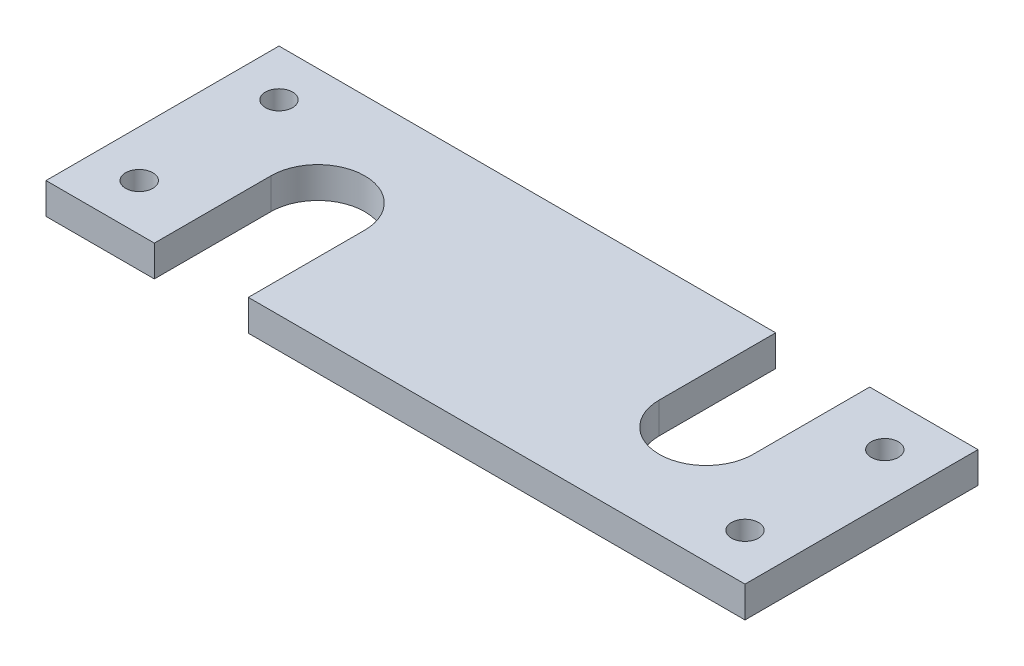
ISO-10303-21;
HEADER;
FILE_DESCRIPTION(('STEP AP214'),'2;1');
FILE_NAME('part.step','',(''),(''),'','','');
FILE_SCHEMA(('AUTOMOTIVE_DESIGN { 1 0 10303 214 1 1 1 1 }'));
ENDSEC;
DATA;
#1=APPLICATION_CONTEXT('core data for automotive mechanical design processes');
#2=APPLICATION_PROTOCOL_DEFINITION('international standard','automotive_design',2000,#1);
#3=PRODUCT_CONTEXT('',#1,'mechanical');
#4=PRODUCT('Part','Part','',(#3));
#5=PRODUCT_RELATED_PRODUCT_CATEGORY('part','',(#4));
#6=PRODUCT_DEFINITION_FORMATION('','',#4);
#7=PRODUCT_DEFINITION_CONTEXT('part definition',#1,'design');
#8=PRODUCT_DEFINITION('design','',#6,#7);
#9=PRODUCT_DEFINITION_SHAPE('','',#8);
#10=(LENGTH_UNIT() NAMED_UNIT(*) SI_UNIT(.MILLI.,.METRE.));
#11=(NAMED_UNIT(*) PLANE_ANGLE_UNIT() SI_UNIT($,.RADIAN.));
#12=(NAMED_UNIT(*) SI_UNIT($,.STERADIAN.) SOLID_ANGLE_UNIT());
#13=UNCERTAINTY_MEASURE_WITH_UNIT(LENGTH_MEASURE(1.E-05),#10,'distance_accuracy_value','');
#14=(GEOMETRIC_REPRESENTATION_CONTEXT(3) GLOBAL_UNCERTAINTY_ASSIGNED_CONTEXT((#13)) GLOBAL_UNIT_ASSIGNED_CONTEXT((#10,
#11,#12)) REPRESENTATION_CONTEXT('',''));
#15=CARTESIAN_POINT('',(0.,0.,0.));
#16=DIRECTION('',(0.,0.,1.));
#17=DIRECTION('',(1.,0.,0.));
#18=AXIS2_PLACEMENT_3D('',#15,#16,#17);
#19=CARTESIAN_POINT('',(0.,4.,-30.));
#20=DIRECTION('',(0.,0.,1.));
#21=DIRECTION('',(1.,0.,0.));
#22=AXIS2_PLACEMENT_3D('',#19,#20,#21);
#23=PLANE('',#22);
#24=DIRECTION('',(-1.,0.,0.));
#25=VECTOR('',#24,1.);
#26=CARTESIAN_POINT('',(0.,0.,-30.));
#27=LINE('',#26,#25);
#28=CARTESIAN_POINT('',(90.,0.,-30.));
#29=VERTEX_POINT('',#28);
#30=CARTESIAN_POINT('',(76.05,0.,-30.));
#31=VERTEX_POINT('',#30);
#32=EDGE_CURVE('E144',#29,#31,#27,.T.);
#33=ORIENTED_EDGE('',*,*,#32,.T.);
#34=DIRECTION('',(0.,1.,0.));
#35=VECTOR('',#34,1.);
#36=CARTESIAN_POINT('',(76.05,0.,-30.));
#37=LINE('',#36,#35);
#38=CARTESIAN_POINT('',(76.05,4.,-30.));
#39=VERTEX_POINT('',#38);
#40=EDGE_CURVE('E184',#31,#39,#37,.T.);
#41=ORIENTED_EDGE('',*,*,#40,.T.);
#42=DIRECTION('',(-1.,0.,0.));
#43=VECTOR('',#42,1.);
#44=CARTESIAN_POINT('',(0.,4.,-30.));
#45=LINE('',#44,#43);
#46=CARTESIAN_POINT('',(90.,4.,-30.));
#47=VERTEX_POINT('',#46);
#48=EDGE_CURVE('E166',#47,#39,#45,.T.);
#49=ORIENTED_EDGE('',*,*,#48,.F.);
#50=DIRECTION('',(0.,-1.,0.));
#51=VECTOR('',#50,1.);
#52=CARTESIAN_POINT('',(90.,4.,-30.));
#53=LINE('',#52,#51);
#54=EDGE_CURVE('E40',#47,#29,#53,.T.);
#55=ORIENTED_EDGE('',*,*,#54,.T.);
#56=EDGE_LOOP('',(#33,#41,#49,#55));
#57=FACE_BOUND('',#56,.T.);
#58=ADVANCED_FACE('F32',(#57),#23,.F.);
#59=CARTESIAN_POINT('',(0.,4.,0.));
#60=DIRECTION('',(0.,0.,-1.));
#61=DIRECTION('',(-1.,0.,0.));
#62=AXIS2_PLACEMENT_3D('',#59,#60,#61);
#63=PLANE('',#62);
#64=DIRECTION('',(1.,0.,0.));
#65=VECTOR('',#64,1.);
#66=CARTESIAN_POINT('',(0.,0.,0.));
#67=LINE('',#66,#65);
#68=CARTESIAN_POINT('',(0.,0.,0.));
#69=VERTEX_POINT('',#68);
#70=CARTESIAN_POINT('',(13.95,0.,0.));
#71=VERTEX_POINT('',#70);
#72=EDGE_CURVE('E148',#69,#71,#67,.T.);
#73=ORIENTED_EDGE('',*,*,#72,.T.);
#74=DIRECTION('',(0.,1.,0.));
#75=VECTOR('',#74,1.);
#76=CARTESIAN_POINT('',(13.95,0.,0.));
#77=LINE('',#76,#75);
#78=CARTESIAN_POINT('',(13.95,4.,0.));
#79=VERTEX_POINT('',#78);
#80=EDGE_CURVE('E198',#71,#79,#77,.T.);
#81=ORIENTED_EDGE('',*,*,#80,.T.);
#82=DIRECTION('',(1.,0.,0.));
#83=VECTOR('',#82,1.);
#84=CARTESIAN_POINT('',(0.,4.,0.));
#85=LINE('',#84,#83);
#86=CARTESIAN_POINT('',(0.,4.,0.));
#87=VERTEX_POINT('',#86);
#88=EDGE_CURVE('E214',#87,#79,#85,.T.);
#89=ORIENTED_EDGE('',*,*,#88,.F.);
#90=DIRECTION('',(0.,-1.,0.));
#91=VECTOR('',#90,1.);
#92=CARTESIAN_POINT('',(0.,4.,0.));
#93=LINE('',#92,#91);
#94=EDGE_CURVE('E154',#87,#69,#93,.T.);
#95=ORIENTED_EDGE('',*,*,#94,.T.);
#96=EDGE_LOOP('',(#73,#81,#89,#95));
#97=FACE_BOUND('',#96,.T.);
#98=ADVANCED_FACE('F239',(#97),#63,.F.);
#99=CARTESIAN_POINT('',(26.05,4.,0.));
#100=VERTEX_POINT('',#99);
#101=CARTESIAN_POINT('',(90.,4.,0.));
#102=VERTEX_POINT('',#101);
#103=EDGE_CURVE('E153',#100,#102,#85,.T.);
#104=ORIENTED_EDGE('',*,*,#103,.F.);
#105=DIRECTION('',(0.,1.,0.));
#106=VECTOR('',#105,1.);
#107=CARTESIAN_POINT('',(26.05,0.,0.));
#108=LINE('',#107,#106);
#109=CARTESIAN_POINT('',(26.05,0.,0.));
#110=VERTEX_POINT('',#109);
#111=EDGE_CURVE('E210',#110,#100,#108,.T.);
#112=ORIENTED_EDGE('',*,*,#111,.F.);
#113=CARTESIAN_POINT('',(90.,0.,0.));
#114=VERTEX_POINT('',#113);
#115=EDGE_CURVE('E207',#110,#114,#67,.T.);
#116=ORIENTED_EDGE('',*,*,#115,.T.);
#117=DIRECTION('',(0.,-1.,0.));
#118=VECTOR('',#117,1.);
#119=CARTESIAN_POINT('',(90.,4.,0.));
#120=LINE('',#119,#118);
#121=EDGE_CURVE('E11',#102,#114,#120,.T.);
#122=ORIENTED_EDGE('',*,*,#121,.F.);
#123=EDGE_LOOP('',(#104,#112,#116,#122));
#124=FACE_BOUND('',#123,.T.);
#125=ADVANCED_FACE('F34',(#124),#63,.F.);
#126=CARTESIAN_POINT('',(90.,4.,0.));
#127=DIRECTION('',(-1.,0.,0.));
#128=DIRECTION('',(0.,0.,1.));
#129=AXIS2_PLACEMENT_3D('',#126,#127,#128);
#130=PLANE('',#129);
#131=DIRECTION('',(0.,0.,-1.));
#132=VECTOR('',#131,1.);
#133=CARTESIAN_POINT('',(90.,0.,0.));
#134=LINE('',#133,#132);
#135=EDGE_CURVE('E145',#114,#29,#134,.T.);
#136=ORIENTED_EDGE('',*,*,#135,.T.);
#137=ORIENTED_EDGE('',*,*,#54,.F.);
#138=DIRECTION('',(0.,0.,-1.));
#139=VECTOR('',#138,1.);
#140=CARTESIAN_POINT('',(90.,4.,0.));
#141=LINE('',#140,#139);
#142=EDGE_CURVE('E217',#102,#47,#141,.T.);
#143=ORIENTED_EDGE('',*,*,#142,.F.);
#144=ORIENTED_EDGE('',*,*,#121,.T.);
#145=EDGE_LOOP('',(#136,#137,#143,#144));
#146=FACE_BOUND('',#145,.T.);
#147=ADVANCED_FACE('F247',(#146),#130,.F.);
#148=CARTESIAN_POINT('',(63.95,4.,-30.));
#149=VERTEX_POINT('',#148);
#150=CARTESIAN_POINT('',(0.,4.,-30.));
#151=VERTEX_POINT('',#150);
#152=EDGE_CURVE('E137',#149,#151,#45,.T.);
#153=ORIENTED_EDGE('',*,*,#152,.F.);
#154=DIRECTION('',(0.,1.,0.));
#155=VECTOR('',#154,1.);
#156=CARTESIAN_POINT('',(63.95,0.,-30.));
#157=LINE('',#156,#155);
#158=CARTESIAN_POINT('',(63.95,0.,-30.));
#159=VERTEX_POINT('',#158);
#160=EDGE_CURVE('E124',#159,#149,#157,.T.);
#161=ORIENTED_EDGE('',*,*,#160,.F.);
#162=CARTESIAN_POINT('',(0.,0.,-30.));
#163=VERTEX_POINT('',#162);
#164=EDGE_CURVE('E135',#159,#163,#27,.T.);
#165=ORIENTED_EDGE('',*,*,#164,.T.);
#166=DIRECTION('',(0.,-1.,0.));
#167=VECTOR('',#166,1.);
#168=CARTESIAN_POINT('',(0.,4.,-30.));
#169=LINE('',#168,#167);
#170=EDGE_CURVE('E157',#151,#163,#169,.T.);
#171=ORIENTED_EDGE('',*,*,#170,.F.);
#172=EDGE_LOOP('',(#153,#161,#165,#171));
#173=FACE_BOUND('',#172,.T.);
#174=ADVANCED_FACE('F133',(#173),#23,.F.);
#175=CARTESIAN_POINT('',(0.,4.,0.));
#176=DIRECTION('',(1.,0.,0.));
#177=DIRECTION('',(0.,0.,-1.));
#178=AXIS2_PLACEMENT_3D('',#175,#176,#177);
#179=PLANE('',#178);
#180=DIRECTION('',(0.,0.,1.));
#181=VECTOR('',#180,1.);
#182=CARTESIAN_POINT('',(0.,0.,0.));
#183=LINE('',#182,#181);
#184=EDGE_CURVE('E143',#163,#69,#183,.T.);
#185=ORIENTED_EDGE('',*,*,#184,.T.);
#186=ORIENTED_EDGE('',*,*,#94,.F.);
#187=DIRECTION('',(0.,0.,1.));
#188=VECTOR('',#187,1.);
#189=CARTESIAN_POINT('',(0.,4.,0.));
#190=LINE('',#189,#188);
#191=EDGE_CURVE('E158',#151,#87,#190,.T.);
#192=ORIENTED_EDGE('',*,*,#191,.F.);
#193=ORIENTED_EDGE('',*,*,#170,.T.);
#194=EDGE_LOOP('',(#185,#186,#192,#193));
#195=FACE_BOUND('',#194,.T.);
#196=ADVANCED_FACE('F243',(#195),#179,.F.);
#197=CARTESIAN_POINT('',(0.,4.,0.));
#198=DIRECTION('',(0.,1.,0.));
#199=DIRECTION('',(0.,0.,1.));
#200=AXIS2_PLACEMENT_3D('',#197,#198,#199);
#201=PLANE('',#200);
#202=CARTESIAN_POINT('',(84.,4.,-6.));
#203=DIRECTION('',(0.,1.,0.));
#204=DIRECTION('',(0.,0.,1.));
#205=AXIS2_PLACEMENT_3D('',#202,#203,#204);
#206=CIRCLE('',#205,1.75);
#207=CARTESIAN_POINT('',(84.,4.,-4.25));
#208=VERTEX_POINT('',#207);
#209=EDGE_CURVE('E302',#208,#208,#206,.T.);
#210=ORIENTED_EDGE('',*,*,#209,.F.);
#211=EDGE_LOOP('',(#210));
#212=FACE_BOUND('',#211,.T.);
#213=CARTESIAN_POINT('',(84.,4.,-24.));
#214=DIRECTION('',(0.,1.,0.));
#215=DIRECTION('',(0.,0.,1.));
#216=AXIS2_PLACEMENT_3D('',#213,#214,#215);
#217=CIRCLE('',#216,1.75);
#218=CARTESIAN_POINT('',(84.,4.,-22.25));
#219=VERTEX_POINT('',#218);
#220=EDGE_CURVE('E304',#219,#219,#217,.T.);
#221=ORIENTED_EDGE('',*,*,#220,.F.);
#222=EDGE_LOOP('',(#221));
#223=FACE_BOUND('',#222,.T.);
#224=CARTESIAN_POINT('',(6.00000000000001,4.,-24.));
#225=DIRECTION('',(0.,1.,0.));
#226=DIRECTION('',(0.,0.,1.));
#227=AXIS2_PLACEMENT_3D('',#224,#225,#226);
#228=CIRCLE('',#227,1.75);
#229=CARTESIAN_POINT('',(6.00000000000001,4.,-22.25));
#230=VERTEX_POINT('',#229);
#231=EDGE_CURVE('E310',#230,#230,#228,.T.);
#232=ORIENTED_EDGE('',*,*,#231,.F.);
#233=EDGE_LOOP('',(#232));
#234=FACE_BOUND('',#233,.T.);
#235=CARTESIAN_POINT('',(6.,4.,-6.));
#236=DIRECTION('',(0.,1.,0.));
#237=DIRECTION('',(0.,0.,1.));
#238=AXIS2_PLACEMENT_3D('',#235,#236,#237);
#239=CIRCLE('',#238,1.75);
#240=CARTESIAN_POINT('',(6.,4.,-4.25));
#241=VERTEX_POINT('',#240);
#242=EDGE_CURVE('E316',#241,#241,#239,.T.);
#243=ORIENTED_EDGE('',*,*,#242,.F.);
#244=EDGE_LOOP('',(#243));
#245=FACE_BOUND('',#244,.T.);
#246=DIRECTION('',(0.,0.,-1.));
#247=VECTOR('',#246,1.);
#248=CARTESIAN_POINT('',(76.05,4.,-15.));
#249=LINE('',#248,#247);
#250=CARTESIAN_POINT('',(76.05,4.,-15.));
#251=VERTEX_POINT('',#250);
#252=EDGE_CURVE('E129',#251,#39,#249,.T.);
#253=ORIENTED_EDGE('',*,*,#252,.F.);
#254=CARTESIAN_POINT('',(70.,4.,-15.));
#255=DIRECTION('',(0.,1.,0.));
#256=DIRECTION('',(0.,0.,1.));
#257=AXIS2_PLACEMENT_3D('',#254,#255,#256);
#258=CIRCLE('',#257,6.05000000000001);
#259=CARTESIAN_POINT('',(63.95,4.,-15.));
#260=VERTEX_POINT('',#259);
#261=EDGE_CURVE('E179',#260,#251,#258,.T.);
#262=ORIENTED_EDGE('',*,*,#261,.F.);
#263=DIRECTION('',(0.,0.,1.));
#264=VECTOR('',#263,1.);
#265=CARTESIAN_POINT('',(63.95,4.,-30.));
#266=LINE('',#265,#264);
#267=EDGE_CURVE('E177',#149,#260,#266,.T.);
#268=ORIENTED_EDGE('',*,*,#267,.F.);
#269=ORIENTED_EDGE('',*,*,#152,.T.);
#270=ORIENTED_EDGE('',*,*,#191,.T.);
#271=ORIENTED_EDGE('',*,*,#88,.T.);
#272=DIRECTION('',(0.,0.,1.));
#273=VECTOR('',#272,1.);
#274=CARTESIAN_POINT('',(13.95,4.,-15.));
#275=LINE('',#274,#273);
#276=CARTESIAN_POINT('',(13.95,4.,-15.));
#277=VERTEX_POINT('',#276);
#278=EDGE_CURVE('E186',#277,#79,#275,.T.);
#279=ORIENTED_EDGE('',*,*,#278,.F.);
#280=CARTESIAN_POINT('',(20.,4.,-15.));
#281=DIRECTION('',(0.,1.,0.));
#282=DIRECTION('',(0.,0.,-1.));
#283=AXIS2_PLACEMENT_3D('',#280,#281,#282);
#284=CIRCLE('',#283,6.05);
#285=CARTESIAN_POINT('',(26.05,4.,-15.));
#286=VERTEX_POINT('',#285);
#287=EDGE_CURVE('E194',#286,#277,#284,.T.);
#288=ORIENTED_EDGE('',*,*,#287,.F.);
#289=DIRECTION('',(0.,0.,-1.));
#290=VECTOR('',#289,1.);
#291=CARTESIAN_POINT('',(26.05,4.,0.));
#292=LINE('',#291,#290);
#293=EDGE_CURVE('E200',#100,#286,#292,.T.);
#294=ORIENTED_EDGE('',*,*,#293,.F.);
#295=ORIENTED_EDGE('',*,*,#103,.T.);
#296=ORIENTED_EDGE('',*,*,#142,.T.);
#297=ORIENTED_EDGE('',*,*,#48,.T.);
#298=EDGE_LOOP('',(#253,#262,#268,#269,#270,#271,#279,#288,#294,#295,#296,#297));
#299=FACE_BOUND('',#298,.T.);
#300=ADVANCED_FACE('F235',(#212,#223,#234,#245,#299),#201,.T.);
#301=CARTESIAN_POINT('',(0.,0.,0.));
#302=DIRECTION('',(0.,1.,0.));
#303=DIRECTION('',(0.,0.,1.));
#304=AXIS2_PLACEMENT_3D('',#301,#302,#303);
#305=PLANE('',#304);
#306=CARTESIAN_POINT('',(84.,0.,-6.));
#307=DIRECTION('',(0.,1.,0.));
#308=DIRECTION('',(0.,0.,1.));
#309=AXIS2_PLACEMENT_3D('',#306,#307,#308);
#310=CIRCLE('',#309,1.75);
#311=CARTESIAN_POINT('',(84.,0.,-4.25));
#312=VERTEX_POINT('',#311);
#313=EDGE_CURVE('E299',#312,#312,#310,.T.);
#314=ORIENTED_EDGE('',*,*,#313,.T.);
#315=EDGE_LOOP('',(#314));
#316=FACE_BOUND('',#315,.T.);
#317=CARTESIAN_POINT('',(84.,0.,-24.));
#318=DIRECTION('',(0.,1.,0.));
#319=DIRECTION('',(0.,0.,1.));
#320=AXIS2_PLACEMENT_3D('',#317,#318,#319);
#321=CIRCLE('',#320,1.75);
#322=CARTESIAN_POINT('',(84.,0.,-22.25));
#323=VERTEX_POINT('',#322);
#324=EDGE_CURVE('E307',#323,#323,#321,.T.);
#325=ORIENTED_EDGE('',*,*,#324,.T.);
#326=EDGE_LOOP('',(#325));
#327=FACE_BOUND('',#326,.T.);
#328=CARTESIAN_POINT('',(6.00000000000001,0.,-24.));
#329=DIRECTION('',(0.,1.,0.));
#330=DIRECTION('',(0.,0.,1.));
#331=AXIS2_PLACEMENT_3D('',#328,#329,#330);
#332=CIRCLE('',#331,1.75);
#333=CARTESIAN_POINT('',(6.00000000000001,0.,-22.25));
#334=VERTEX_POINT('',#333);
#335=EDGE_CURVE('E313',#334,#334,#332,.T.);
#336=ORIENTED_EDGE('',*,*,#335,.T.);
#337=EDGE_LOOP('',(#336));
#338=FACE_BOUND('',#337,.T.);
#339=CARTESIAN_POINT('',(6.,0.,-6.));
#340=DIRECTION('',(0.,1.,0.));
#341=DIRECTION('',(0.,0.,1.));
#342=AXIS2_PLACEMENT_3D('',#339,#340,#341);
#343=CIRCLE('',#342,1.75);
#344=CARTESIAN_POINT('',(6.,0.,-4.25));
#345=VERTEX_POINT('',#344);
#346=EDGE_CURVE('E180',#345,#345,#343,.T.);
#347=ORIENTED_EDGE('',*,*,#346,.T.);
#348=EDGE_LOOP('',(#347));
#349=FACE_BOUND('',#348,.T.);
#350=CARTESIAN_POINT('',(70.,0.,-15.));
#351=DIRECTION('',(0.,1.,0.));
#352=DIRECTION('',(0.,0.,1.));
#353=AXIS2_PLACEMENT_3D('',#350,#351,#352);
#354=CIRCLE('',#353,6.05000000000001);
#355=CARTESIAN_POINT('',(63.95,0.,-15.));
#356=VERTEX_POINT('',#355);
#357=CARTESIAN_POINT('',(76.05,0.,-15.));
#358=VERTEX_POINT('',#357);
#359=EDGE_CURVE('E47',#356,#358,#354,.T.);
#360=ORIENTED_EDGE('',*,*,#359,.T.);
#361=DIRECTION('',(0.,0.,-1.));
#362=VECTOR('',#361,1.);
#363=CARTESIAN_POINT('',(76.05,0.,-15.));
#364=LINE('',#363,#362);
#365=EDGE_CURVE('E138',#358,#31,#364,.T.);
#366=ORIENTED_EDGE('',*,*,#365,.T.);
#367=ORIENTED_EDGE('',*,*,#32,.F.);
#368=ORIENTED_EDGE('',*,*,#135,.F.);
#369=ORIENTED_EDGE('',*,*,#115,.F.);
#370=DIRECTION('',(0.,0.,-1.));
#371=VECTOR('',#370,1.);
#372=CARTESIAN_POINT('',(26.05,0.,0.));
#373=LINE('',#372,#371);
#374=CARTESIAN_POINT('',(26.05,0.,-15.));
#375=VERTEX_POINT('',#374);
#376=EDGE_CURVE('E193',#110,#375,#373,.T.);
#377=ORIENTED_EDGE('',*,*,#376,.T.);
#378=CARTESIAN_POINT('',(20.,0.,-15.));
#379=DIRECTION('',(0.,1.,0.));
#380=DIRECTION('',(0.,0.,-1.));
#381=AXIS2_PLACEMENT_3D('',#378,#379,#380);
#382=CIRCLE('',#381,6.05);
#383=CARTESIAN_POINT('',(13.95,0.,-15.));
#384=VERTEX_POINT('',#383);
#385=EDGE_CURVE('E55',#375,#384,#382,.T.);
#386=ORIENTED_EDGE('',*,*,#385,.T.);
#387=DIRECTION('',(0.,0.,1.));
#388=VECTOR('',#387,1.);
#389=CARTESIAN_POINT('',(13.95,0.,-15.));
#390=LINE('',#389,#388);
#391=EDGE_CURVE('E190',#384,#71,#390,.T.);
#392=ORIENTED_EDGE('',*,*,#391,.T.);
#393=ORIENTED_EDGE('',*,*,#72,.F.);
#394=ORIENTED_EDGE('',*,*,#184,.F.);
#395=ORIENTED_EDGE('',*,*,#164,.F.);
#396=DIRECTION('',(0.,0.,1.));
#397=VECTOR('',#396,1.);
#398=CARTESIAN_POINT('',(63.95,0.,-30.));
#399=LINE('',#398,#397);
#400=EDGE_CURVE('E120',#159,#356,#399,.T.);
#401=ORIENTED_EDGE('',*,*,#400,.T.);
#402=EDGE_LOOP('',(#360,#366,#367,#368,#369,#377,#386,#392,#393,#394,#395,#401));
#403=FACE_BOUND('',#402,.T.);
#404=ADVANCED_FACE('F141',(#316,#327,#338,#349,#403),#305,.F.);
#405=CARTESIAN_POINT('',(13.95,0.,-15.));
#406=DIRECTION('',(-1.,0.,0.));
#407=DIRECTION('',(0.,0.,1.));
#408=AXIS2_PLACEMENT_3D('',#405,#406,#407);
#409=PLANE('',#408);
#410=ORIENTED_EDGE('',*,*,#278,.T.);
#411=ORIENTED_EDGE('',*,*,#80,.F.);
#412=ORIENTED_EDGE('',*,*,#391,.F.);
#413=DIRECTION('',(0.,1.,0.));
#414=VECTOR('',#413,1.);
#415=CARTESIAN_POINT('',(13.95,0.,-15.));
#416=LINE('',#415,#414);
#417=EDGE_CURVE('E205',#384,#277,#416,.T.);
#418=ORIENTED_EDGE('',*,*,#417,.T.);
#419=EDGE_LOOP('',(#410,#411,#412,#418));
#420=FACE_BOUND('',#419,.T.);
#421=ADVANCED_FACE('F238',(#420),#409,.F.);
#422=CARTESIAN_POINT('',(20.,0.,-15.));
#423=DIRECTION('',(0.,1.,0.));
#424=DIRECTION('',(0.,0.,1.));
#425=AXIS2_PLACEMENT_3D('',#422,#423,#424);
#426=CYLINDRICAL_SURFACE('',#425,6.05);
#427=ORIENTED_EDGE('',*,*,#287,.T.);
#428=ORIENTED_EDGE('',*,*,#417,.F.);
#429=ORIENTED_EDGE('',*,*,#385,.F.);
#430=DIRECTION('',(0.,1.,0.));
#431=VECTOR('',#430,1.);
#432=CARTESIAN_POINT('',(26.05,0.,-15.));
#433=LINE('',#432,#431);
#434=EDGE_CURVE('E208',#375,#286,#433,.T.);
#435=ORIENTED_EDGE('',*,*,#434,.T.);
#436=EDGE_LOOP('',(#427,#428,#429,#435));
#437=FACE_BOUND('',#436,.T.);
#438=ADVANCED_FACE('F230',(#437),#426,.F.);
#439=CARTESIAN_POINT('',(26.05,0.,0.));
#440=DIRECTION('',(1.,0.,0.));
#441=DIRECTION('',(0.,0.,-1.));
#442=AXIS2_PLACEMENT_3D('',#439,#440,#441);
#443=PLANE('',#442);
#444=ORIENTED_EDGE('',*,*,#293,.T.);
#445=ORIENTED_EDGE('',*,*,#434,.F.);
#446=ORIENTED_EDGE('',*,*,#376,.F.);
#447=ORIENTED_EDGE('',*,*,#111,.T.);
#448=EDGE_LOOP('',(#444,#445,#446,#447));
#449=FACE_BOUND('',#448,.T.);
#450=ADVANCED_FACE('F227',(#449),#443,.F.);
#451=CARTESIAN_POINT('',(76.05,0.,-15.));
#452=DIRECTION('',(1.,0.,0.));
#453=DIRECTION('',(0.,0.,-1.));
#454=AXIS2_PLACEMENT_3D('',#451,#452,#453);
#455=PLANE('',#454);
#456=ORIENTED_EDGE('',*,*,#252,.T.);
#457=ORIENTED_EDGE('',*,*,#40,.F.);
#458=ORIENTED_EDGE('',*,*,#365,.F.);
#459=DIRECTION('',(0.,1.,0.));
#460=VECTOR('',#459,1.);
#461=CARTESIAN_POINT('',(76.05,0.,-15.));
#462=LINE('',#461,#460);
#463=EDGE_CURVE('E187',#358,#251,#462,.T.);
#464=ORIENTED_EDGE('',*,*,#463,.T.);
#465=EDGE_LOOP('',(#456,#457,#458,#464));
#466=FACE_BOUND('',#465,.T.);
#467=ADVANCED_FACE('F246',(#466),#455,.F.);
#468=CARTESIAN_POINT('',(70.,0.,-15.));
#469=DIRECTION('',(0.,1.,0.));
#470=DIRECTION('',(0.,0.,1.));
#471=AXIS2_PLACEMENT_3D('',#468,#469,#470);
#472=CYLINDRICAL_SURFACE('',#471,6.05000000000001);
#473=ORIENTED_EDGE('',*,*,#261,.T.);
#474=ORIENTED_EDGE('',*,*,#463,.F.);
#475=ORIENTED_EDGE('',*,*,#359,.F.);
#476=DIRECTION('',(0.,1.,0.));
#477=VECTOR('',#476,1.);
#478=CARTESIAN_POINT('',(63.95,0.,-15.));
#479=LINE('',#478,#477);
#480=EDGE_CURVE('E126',#356,#260,#479,.T.);
#481=ORIENTED_EDGE('',*,*,#480,.T.);
#482=EDGE_LOOP('',(#473,#474,#475,#481));
#483=FACE_BOUND('',#482,.T.);
#484=ADVANCED_FACE('F245',(#483),#472,.F.);
#485=CARTESIAN_POINT('',(63.95,0.,-30.));
#486=DIRECTION('',(-1.,0.,0.));
#487=DIRECTION('',(0.,0.,1.));
#488=AXIS2_PLACEMENT_3D('',#485,#486,#487);
#489=PLANE('',#488);
#490=ORIENTED_EDGE('',*,*,#267,.T.);
#491=ORIENTED_EDGE('',*,*,#480,.F.);
#492=ORIENTED_EDGE('',*,*,#400,.F.);
#493=ORIENTED_EDGE('',*,*,#160,.T.);
#494=EDGE_LOOP('',(#490,#491,#492,#493));
#495=FACE_BOUND('',#494,.T.);
#496=ADVANCED_FACE('F123',(#495),#489,.F.);
#497=CARTESIAN_POINT('',(6.,0.,-6.));
#498=DIRECTION('',(0.,1.,0.));
#499=DIRECTION('',(0.,0.,1.));
#500=AXIS2_PLACEMENT_3D('',#497,#498,#499);
#501=CYLINDRICAL_SURFACE('',#500,1.75);
#502=ORIENTED_EDGE('',*,*,#346,.F.);
#503=EDGE_LOOP('',(#502));
#504=FACE_BOUND('',#503,.T.);
#505=ORIENTED_EDGE('',*,*,#242,.T.);
#506=EDGE_LOOP('',(#505));
#507=FACE_BOUND('',#506,.T.);
#508=ADVANCED_FACE('F275',(#504,#507),#501,.F.);
#509=CARTESIAN_POINT('',(6.00000000000001,0.,-24.));
#510=DIRECTION('',(0.,1.,0.));
#511=DIRECTION('',(0.,0.,1.));
#512=AXIS2_PLACEMENT_3D('',#509,#510,#511);
#513=CYLINDRICAL_SURFACE('',#512,1.75);
#514=ORIENTED_EDGE('',*,*,#335,.F.);
#515=EDGE_LOOP('',(#514));
#516=FACE_BOUND('',#515,.T.);
#517=ORIENTED_EDGE('',*,*,#231,.T.);
#518=EDGE_LOOP('',(#517));
#519=FACE_BOUND('',#518,.T.);
#520=ADVANCED_FACE('F282',(#516,#519),#513,.F.);
#521=CARTESIAN_POINT('',(84.,0.,-24.));
#522=DIRECTION('',(0.,1.,0.));
#523=DIRECTION('',(0.,0.,1.));
#524=AXIS2_PLACEMENT_3D('',#521,#522,#523);
#525=CYLINDRICAL_SURFACE('',#524,1.75);
#526=ORIENTED_EDGE('',*,*,#324,.F.);
#527=EDGE_LOOP('',(#526));
#528=FACE_BOUND('',#527,.T.);
#529=ORIENTED_EDGE('',*,*,#220,.T.);
#530=EDGE_LOOP('',(#529));
#531=FACE_BOUND('',#530,.T.);
#532=ADVANCED_FACE('F286',(#528,#531),#525,.F.);
#533=CARTESIAN_POINT('',(84.,0.,-6.));
#534=DIRECTION('',(0.,1.,0.));
#535=DIRECTION('',(0.,0.,1.));
#536=AXIS2_PLACEMENT_3D('',#533,#534,#535);
#537=CYLINDRICAL_SURFACE('',#536,1.75);
#538=ORIENTED_EDGE('',*,*,#313,.F.);
#539=EDGE_LOOP('',(#538));
#540=FACE_BOUND('',#539,.T.);
#541=ORIENTED_EDGE('',*,*,#209,.T.);
#542=EDGE_LOOP('',(#541));
#543=FACE_BOUND('',#542,.T.);
#544=ADVANCED_FACE('F290',(#540,#543),#537,.F.);
#545=CLOSED_SHELL('',(#58,#98,#125,#147,#174,#196,#300,#404,#421,#438,#450,#467,#484,#496,#508,
#520,#532,#544));
#546=MANIFOLD_SOLID_BREP('B2',#545);
#547=ADVANCED_BREP_SHAPE_REPRESENTATION('',(#18,#546),#14);
#548=SHAPE_DEFINITION_REPRESENTATION(#9,#547);
ENDSEC;
END-ISO-10303-21;
